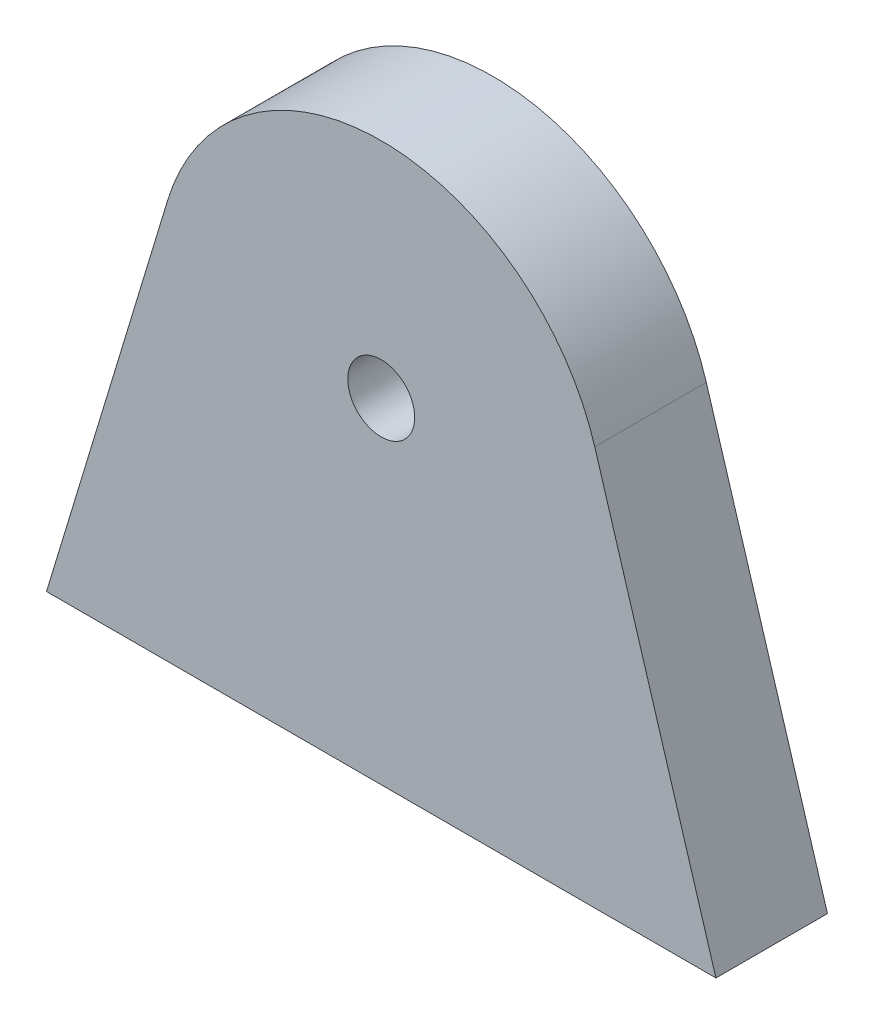
ISO-10303-21;
HEADER;
FILE_DESCRIPTION(('STEP AP214'),'2;1');
FILE_NAME('part.step','',(''),(''),'','','');
FILE_SCHEMA(('AUTOMOTIVE_DESIGN { 1 0 10303 214 1 1 1 1 }'));
ENDSEC;
DATA;
#1=APPLICATION_CONTEXT('core data for automotive mechanical design processes');
#2=APPLICATION_PROTOCOL_DEFINITION('international standard','automotive_design',2000,#1);
#3=PRODUCT_CONTEXT('',#1,'mechanical');
#4=PRODUCT('Part','Part','',(#3));
#5=PRODUCT_RELATED_PRODUCT_CATEGORY('part','',(#4));
#6=PRODUCT_DEFINITION_FORMATION('','',#4);
#7=PRODUCT_DEFINITION_CONTEXT('part definition',#1,'design');
#8=PRODUCT_DEFINITION('design','',#6,#7);
#9=PRODUCT_DEFINITION_SHAPE('','',#8);
#10=(LENGTH_UNIT() NAMED_UNIT(*) SI_UNIT(.MILLI.,.METRE.));
#11=(NAMED_UNIT(*) PLANE_ANGLE_UNIT() SI_UNIT($,.RADIAN.));
#12=(NAMED_UNIT(*) SI_UNIT($,.STERADIAN.) SOLID_ANGLE_UNIT());
#13=UNCERTAINTY_MEASURE_WITH_UNIT(LENGTH_MEASURE(1.E-05),#10,'distance_accuracy_value','');
#14=(GEOMETRIC_REPRESENTATION_CONTEXT(3) GLOBAL_UNCERTAINTY_ASSIGNED_CONTEXT((#13)) GLOBAL_UNIT_ASSIGNED_CONTEXT((#10,
#11,#12)) REPRESENTATION_CONTEXT('',''));
#15=CARTESIAN_POINT('',(0.,0.,0.));
#16=DIRECTION('',(0.,0.,1.));
#17=DIRECTION('',(1.,0.,0.));
#18=AXIS2_PLACEMENT_3D('',#15,#16,#17);
#19=CARTESIAN_POINT('',(4.5783754407582,2.64831816104883,0.));
#20=DIRECTION('',(0.,0.,-1.));
#21=DIRECTION('',(-1.,0.,0.));
#22=AXIS2_PLACEMENT_3D('',#19,#20,#21);
#23=CYLINDRICAL_SURFACE('',#22,3.);
#24=CARTESIAN_POINT('',(4.5783754407582,2.64831816104883,10.));
#25=DIRECTION('',(0.,0.,-1.));
#26=DIRECTION('',(-1.,0.,0.));
#27=AXIS2_PLACEMENT_3D('',#24,#25,#26);
#28=CIRCLE('',#27,3.);
#29=CARTESIAN_POINT('',(7.5783754407582,2.64831816104883,10.));
#30=VERTEX_POINT('',#29);
#31=EDGE_CURVE('E53',#30,#30,#28,.T.);
#32=ORIENTED_EDGE('',*,*,#31,.F.);
#33=EDGE_LOOP('',(#32));
#34=FACE_BOUND('',#33,.T.);
#35=CARTESIAN_POINT('',(4.5783754407582,2.64831816104883,0.));
#36=DIRECTION('',(0.,0.,1.));
#37=DIRECTION('',(-1.,0.,0.));
#38=AXIS2_PLACEMENT_3D('',#35,#36,#37);
#39=CIRCLE('',#38,3.);
#40=CARTESIAN_POINT('',(7.5783754407582,2.64831816104883,0.));
#41=VERTEX_POINT('',#40);
#42=EDGE_CURVE('E99',#41,#41,#39,.T.);
#43=ORIENTED_EDGE('',*,*,#42,.F.);
#44=EDGE_LOOP('',(#43));
#45=FACE_BOUND('',#44,.T.);
#46=ADVANCED_FACE('F35',(#34,#45),#23,.F.);
#47=CARTESIAN_POINT('',(-25.4216245592418,-27.3516818389512,0.));
#48=DIRECTION('',(-0.956942897795657,0.29027623112899,0.));
#49=DIRECTION('',(0.,0.,1.));
#50=AXIS2_PLACEMENT_3D('',#47,#48,#49);
#51=PLANE('',#50);
#52=DIRECTION('',(0.29027623112899,0.956942897795657,0.));
#53=VECTOR('',#52,1.);
#54=CARTESIAN_POINT('',(-14.5604825151549,8.45384278362862,10.));
#55=LINE('',#54,#53);
#56=CARTESIAN_POINT('',(-25.4216245592418,-27.3516818389512,10.));
#57=VERTEX_POINT('',#56);
#58=CARTESIAN_POINT('',(-14.5604825151549,8.45384278362862,10.));
#59=VERTEX_POINT('',#58);
#60=EDGE_CURVE('E11',#57,#59,#55,.T.);
#61=ORIENTED_EDGE('',*,*,#60,.T.);
#62=DIRECTION('',(0.,0.,1.));
#63=VECTOR('',#62,1.);
#64=CARTESIAN_POINT('',(-14.5604825151549,8.45384278362862,0.));
#65=LINE('',#64,#63);
#66=CARTESIAN_POINT('',(-14.5604825151549,8.45384278362862,0.));
#67=VERTEX_POINT('',#66);
#68=EDGE_CURVE('E65',#67,#59,#65,.T.);
#69=ORIENTED_EDGE('',*,*,#68,.F.);
#70=DIRECTION('',(-0.29027623112899,-0.956942897795657,0.));
#71=VECTOR('',#70,1.);
#72=CARTESIAN_POINT('',(-14.5604825151549,8.45384278362862,0.));
#73=LINE('',#72,#71);
#74=CARTESIAN_POINT('',(-25.4216245592418,-27.3516818389512,0.));
#75=VERTEX_POINT('',#74);
#76=EDGE_CURVE('E46',#67,#75,#73,.T.);
#77=ORIENTED_EDGE('',*,*,#76,.T.);
#78=DIRECTION('',(0.,0.,1.));
#79=VECTOR('',#78,1.);
#80=CARTESIAN_POINT('',(-25.4216245592418,-27.3516818389512,0.));
#81=LINE('',#80,#79);
#82=EDGE_CURVE('E81',#75,#57,#81,.T.);
#83=ORIENTED_EDGE('',*,*,#82,.T.);
#84=EDGE_LOOP('',(#61,#69,#77,#83));
#85=FACE_BOUND('',#84,.T.);
#86=ADVANCED_FACE('F37',(#85),#51,.T.);
#87=CARTESIAN_POINT('',(4.5783754407582,2.64831816104883,0.));
#88=DIRECTION('',(0.,0.,-1.));
#89=DIRECTION('',(0.956942897795657,0.29027623112899,0.));
#90=AXIS2_PLACEMENT_3D('',#87,#88,#89);
#91=CYLINDRICAL_SURFACE('',#90,20.);
#92=CARTESIAN_POINT('',(4.5783754407582,2.64831816104883,10.));
#93=DIRECTION('',(0.,0.,-1.));
#94=DIRECTION('',(0.956942897795657,0.29027623112899,0.));
#95=AXIS2_PLACEMENT_3D('',#92,#93,#94);
#96=CIRCLE('',#95,20.);
#97=CARTESIAN_POINT('',(23.7172333966714,8.45384278362862,10.));
#98=VERTEX_POINT('',#97);
#99=EDGE_CURVE('E39',#59,#98,#96,.T.);
#100=ORIENTED_EDGE('',*,*,#99,.T.);
#101=DIRECTION('',(0.,0.,1.));
#102=VECTOR('',#101,1.);
#103=CARTESIAN_POINT('',(23.7172333966714,8.45384278362862,0.));
#104=LINE('',#103,#102);
#105=CARTESIAN_POINT('',(23.7172333966714,8.45384278362862,0.));
#106=VERTEX_POINT('',#105);
#107=EDGE_CURVE('E106',#106,#98,#104,.T.);
#108=ORIENTED_EDGE('',*,*,#107,.F.);
#109=CARTESIAN_POINT('',(4.5783754407582,2.64831816104883,0.));
#110=DIRECTION('',(0.,0.,1.));
#111=DIRECTION('',(0.956942897795657,0.29027623112899,0.));
#112=AXIS2_PLACEMENT_3D('',#109,#110,#111);
#113=CIRCLE('',#112,20.);
#114=EDGE_CURVE('E71',#106,#67,#113,.T.);
#115=ORIENTED_EDGE('',*,*,#114,.T.);
#116=ORIENTED_EDGE('',*,*,#68,.T.);
#117=EDGE_LOOP('',(#100,#108,#115,#116));
#118=FACE_BOUND('',#117,.T.);
#119=ADVANCED_FACE('F66',(#118),#91,.T.);
#120=CARTESIAN_POINT('',(23.7172333966714,8.45384278362862,0.));
#121=DIRECTION('',(0.956942897795657,0.29027623112899,0.));
#122=DIRECTION('',(0.,0.,-1.));
#123=AXIS2_PLACEMENT_3D('',#120,#121,#122);
#124=PLANE('',#123);
#125=DIRECTION('',(0.29027623112899,-0.956942897795657,0.));
#126=VECTOR('',#125,1.);
#127=CARTESIAN_POINT('',(34.5783754407582,-27.3516818389512,10.));
#128=LINE('',#127,#126);
#129=CARTESIAN_POINT('',(34.5783754407582,-27.3516818389512,10.));
#130=VERTEX_POINT('',#129);
#131=EDGE_CURVE('E76',#98,#130,#128,.T.);
#132=ORIENTED_EDGE('',*,*,#131,.T.);
#133=DIRECTION('',(0.,0.,1.));
#134=VECTOR('',#133,1.);
#135=CARTESIAN_POINT('',(34.5783754407582,-27.3516818389512,0.));
#136=LINE('',#135,#134);
#137=CARTESIAN_POINT('',(34.5783754407582,-27.3516818389512,0.));
#138=VERTEX_POINT('',#137);
#139=EDGE_CURVE('E101',#138,#130,#136,.T.);
#140=ORIENTED_EDGE('',*,*,#139,.F.);
#141=DIRECTION('',(-0.29027623112899,0.956942897795657,0.));
#142=VECTOR('',#141,1.);
#143=CARTESIAN_POINT('',(34.5783754407582,-27.3516818389512,0.));
#144=LINE('',#143,#142);
#145=EDGE_CURVE('E105',#138,#106,#144,.T.);
#146=ORIENTED_EDGE('',*,*,#145,.T.);
#147=ORIENTED_EDGE('',*,*,#107,.T.);
#148=EDGE_LOOP('',(#132,#140,#146,#147));
#149=FACE_BOUND('',#148,.T.);
#150=ADVANCED_FACE('F117',(#149),#124,.T.);
#151=CARTESIAN_POINT('',(4.5783754407582,-13.3128501131262,0.));
#152=DIRECTION('',(0.,0.,1.));
#153=DIRECTION('',(1.,0.,0.));
#154=AXIS2_PLACEMENT_3D('',#151,#152,#153);
#155=PLANE('',#154);
#156=ORIENTED_EDGE('',*,*,#42,.T.);
#157=EDGE_LOOP('',(#156));
#158=FACE_BOUND('',#157,.T.);
#159=ORIENTED_EDGE('',*,*,#145,.F.);
#160=DIRECTION('',(1.,0.,0.));
#161=VECTOR('',#160,1.);
#162=CARTESIAN_POINT('',(34.5783754407582,-27.3516818389512,0.));
#163=LINE('',#162,#161);
#164=EDGE_CURVE('E126',#75,#138,#163,.T.);
#165=ORIENTED_EDGE('',*,*,#164,.F.);
#166=ORIENTED_EDGE('',*,*,#76,.F.);
#167=ORIENTED_EDGE('',*,*,#114,.F.);
#168=EDGE_LOOP('',(#159,#165,#166,#167));
#169=FACE_BOUND('',#168,.T.);
#170=ADVANCED_FACE('F123',(#158,#169),#155,.F.);
#171=CARTESIAN_POINT('',(4.5783754407582,-13.3128501131262,10.));
#172=DIRECTION('',(0.,0.,1.));
#173=DIRECTION('',(1.,0.,0.));
#174=AXIS2_PLACEMENT_3D('',#171,#172,#173);
#175=PLANE('',#174);
#176=DIRECTION('',(-1.,0.,0.));
#177=VECTOR('',#176,1.);
#178=CARTESIAN_POINT('',(34.5783754407582,-27.3516818389512,10.));
#179=LINE('',#178,#177);
#180=EDGE_CURVE('E133',#130,#57,#179,.T.);
#181=ORIENTED_EDGE('',*,*,#180,.F.);
#182=ORIENTED_EDGE('',*,*,#131,.F.);
#183=ORIENTED_EDGE('',*,*,#99,.F.);
#184=ORIENTED_EDGE('',*,*,#60,.F.);
#185=EDGE_LOOP('',(#181,#182,#183,#184));
#186=FACE_BOUND('',#185,.T.);
#187=ORIENTED_EDGE('',*,*,#31,.T.);
#188=EDGE_LOOP('',(#187));
#189=FACE_BOUND('',#188,.T.);
#190=ADVANCED_FACE('F84',(#186,#189),#175,.T.);
#191=CARTESIAN_POINT('',(0.,-27.3516818389512,0.));
#192=DIRECTION('',(0.,1.,0.));
#193=DIRECTION('',(0.,0.,1.));
#194=AXIS2_PLACEMENT_3D('',#191,#192,#193);
#195=PLANE('',#194);
#196=ORIENTED_EDGE('',*,*,#139,.T.);
#197=ORIENTED_EDGE('',*,*,#180,.T.);
#198=ORIENTED_EDGE('',*,*,#82,.F.);
#199=ORIENTED_EDGE('',*,*,#164,.T.);
#200=EDGE_LOOP('',(#196,#197,#198,#199));
#201=FACE_BOUND('',#200,.T.);
#202=ADVANCED_FACE('F134',(#201),#195,.F.);
#203=CLOSED_SHELL('',(#46,#86,#119,#150,#170,#190,#202));
#204=MANIFOLD_SOLID_BREP('B2',#203);
#205=ADVANCED_BREP_SHAPE_REPRESENTATION('',(#18,#204),#14);
#206=SHAPE_DEFINITION_REPRESENTATION(#9,#205);
ENDSEC;
END-ISO-10303-21;
